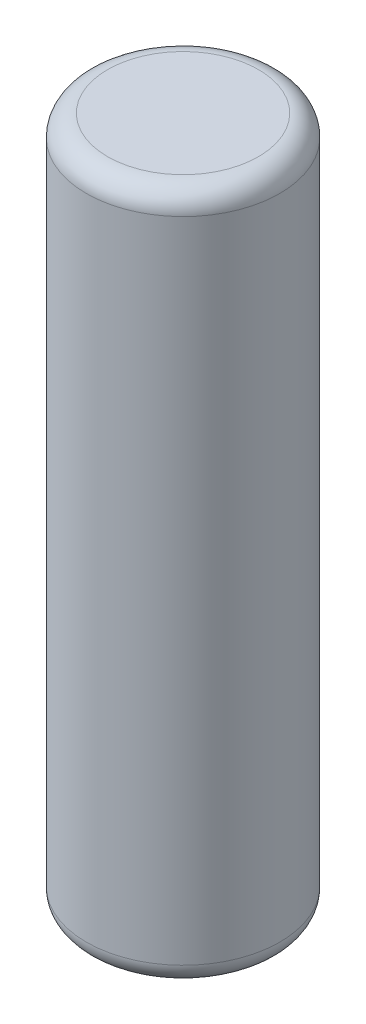
ISO-10303-21;
HEADER;
FILE_DESCRIPTION(('STEP AP214'),'2;1');
FILE_NAME('part.step','',(''),(''),'','','');
FILE_SCHEMA(('AUTOMOTIVE_DESIGN { 1 0 10303 214 1 1 1 1 }'));
ENDSEC;
DATA;
#1=APPLICATION_CONTEXT('core data for automotive mechanical design processes');
#2=APPLICATION_PROTOCOL_DEFINITION('international standard','automotive_design',2000,#1);
#3=PRODUCT_CONTEXT('',#1,'mechanical');
#4=PRODUCT('Part','Part','',(#3));
#5=PRODUCT_RELATED_PRODUCT_CATEGORY('part','',(#4));
#6=PRODUCT_DEFINITION_FORMATION('','',#4);
#7=PRODUCT_DEFINITION_CONTEXT('part definition',#1,'design');
#8=PRODUCT_DEFINITION('design','',#6,#7);
#9=PRODUCT_DEFINITION_SHAPE('','',#8);
#10=(LENGTH_UNIT() NAMED_UNIT(*) SI_UNIT(.MILLI.,.METRE.));
#11=(NAMED_UNIT(*) PLANE_ANGLE_UNIT() SI_UNIT($,.RADIAN.));
#12=(NAMED_UNIT(*) SI_UNIT($,.STERADIAN.) SOLID_ANGLE_UNIT());
#13=UNCERTAINTY_MEASURE_WITH_UNIT(LENGTH_MEASURE(1.E-05),#10,'distance_accuracy_value','');
#14=(GEOMETRIC_REPRESENTATION_CONTEXT(3) GLOBAL_UNCERTAINTY_ASSIGNED_CONTEXT((#13)) GLOBAL_UNIT_ASSIGNED_CONTEXT((#10,
#11,#12)) REPRESENTATION_CONTEXT('',''));
#15=CARTESIAN_POINT('',(0.,0.,0.));
#16=DIRECTION('',(0.,0.,1.));
#17=DIRECTION('',(1.,0.,0.));
#18=AXIS2_PLACEMENT_3D('',#15,#16,#17);
#19=CARTESIAN_POINT('',(0.,0.,0.));
#20=DIRECTION('',(0.,1.,0.));
#21=DIRECTION('',(0.,0.,1.));
#22=AXIS2_PLACEMENT_3D('',#19,#20,#21);
#23=PLANE('',#22);
#24=CARTESIAN_POINT('',(0.,0.,0.));
#25=DIRECTION('',(0.,1.,0.));
#26=DIRECTION('',(0.,0.,1.));
#27=AXIS2_PLACEMENT_3D('',#24,#25,#26);
#28=CIRCLE('',#27,7.09999999999999);
#29=CARTESIAN_POINT('',(0.,0.,7.09999999999999));
#30=VERTEX_POINT('',#29);
#31=EDGE_CURVE('E10',#30,#30,#28,.T.);
#32=ORIENTED_EDGE('',*,*,#31,.F.);
#33=EDGE_LOOP('',(#32));
#34=FACE_BOUND('',#33,.T.);
#35=ADVANCED_FACE('F33',(#34),#23,.F.);
#36=CARTESIAN_POINT('',(0.,2.,0.));
#37=DIRECTION('',(0.,1.,0.));
#38=DIRECTION('',(0.,0.,1.));
#39=AXIS2_PLACEMENT_3D('',#36,#37,#38);
#40=TOROIDAL_SURFACE('',#39,7.1,2.);
#41=CARTESIAN_POINT('',(0.,2.,0.));
#42=DIRECTION('',(0.,1.,0.));
#43=DIRECTION('',(0.,0.,1.));
#44=AXIS2_PLACEMENT_3D('',#41,#42,#43);
#45=CIRCLE('',#44,9.1);
#46=CARTESIAN_POINT('',(0.,2.,9.1));
#47=VERTEX_POINT('',#46);
#48=EDGE_CURVE('E39',#47,#47,#45,.T.);
#49=ORIENTED_EDGE('',*,*,#48,.F.);
#50=EDGE_LOOP('',(#49));
#51=FACE_BOUND('',#50,.T.);
#52=ORIENTED_EDGE('',*,*,#31,.T.);
#53=EDGE_LOOP('',(#52));
#54=FACE_BOUND('',#53,.T.);
#55=ADVANCED_FACE('F63',(#51,#54),#40,.T.);
#56=CARTESIAN_POINT('',(0.,65.,0.));
#57=DIRECTION('',(0.,1.,0.));
#58=DIRECTION('',(0.,0.,1.));
#59=AXIS2_PLACEMENT_3D('',#56,#57,#58);
#60=CYLINDRICAL_SURFACE('',#59,9.1);
#61=CARTESIAN_POINT('',(0.,63.,0.));
#62=DIRECTION('',(0.,1.,0.));
#63=DIRECTION('',(0.,0.,1.));
#64=AXIS2_PLACEMENT_3D('',#61,#62,#63);
#65=CIRCLE('',#64,9.1);
#66=CARTESIAN_POINT('',(0.,63.,9.1));
#67=VERTEX_POINT('',#66);
#68=EDGE_CURVE('E43',#67,#67,#65,.T.);
#69=ORIENTED_EDGE('',*,*,#68,.F.);
#70=EDGE_LOOP('',(#69));
#71=FACE_BOUND('',#70,.T.);
#72=ORIENTED_EDGE('',*,*,#48,.T.);
#73=EDGE_LOOP('',(#72));
#74=FACE_BOUND('',#73,.T.);
#75=ADVANCED_FACE('F58',(#71,#74),#60,.T.);
#76=CARTESIAN_POINT('',(0.,63.,0.));
#77=DIRECTION('',(0.,1.,0.));
#78=DIRECTION('',(0.,0.,1.));
#79=AXIS2_PLACEMENT_3D('',#76,#77,#78);
#80=TOROIDAL_SURFACE('',#79,7.1,2.);
#81=CARTESIAN_POINT('',(0.,65.,0.));
#82=DIRECTION('',(0.,1.,0.));
#83=DIRECTION('',(0.,0.,1.));
#84=AXIS2_PLACEMENT_3D('',#81,#82,#83);
#85=CIRCLE('',#84,7.09999999999999);
#86=CARTESIAN_POINT('',(0.,65.,7.09999999999999));
#87=VERTEX_POINT('',#86);
#88=EDGE_CURVE('E47',#87,#87,#85,.T.);
#89=ORIENTED_EDGE('',*,*,#88,.F.);
#90=EDGE_LOOP('',(#89));
#91=FACE_BOUND('',#90,.T.);
#92=ORIENTED_EDGE('',*,*,#68,.T.);
#93=EDGE_LOOP('',(#92));
#94=FACE_BOUND('',#93,.T.);
#95=ADVANCED_FACE('F55',(#91,#94),#80,.T.);
#96=CARTESIAN_POINT('',(7.09999999999999,65.,0.));
#97=DIRECTION('',(0.,-1.,0.));
#98=DIRECTION('',(0.,0.,-1.));
#99=AXIS2_PLACEMENT_3D('',#96,#97,#98);
#100=PLANE('',#99);
#101=ORIENTED_EDGE('',*,*,#88,.T.);
#102=EDGE_LOOP('',(#101));
#103=FACE_BOUND('',#102,.T.);
#104=ADVANCED_FACE('F53',(#103),#100,.F.);
#105=CLOSED_SHELL('',(#35,#55,#75,#95,#104));
#106=MANIFOLD_SOLID_BREP('B2',#105);
#107=ADVANCED_BREP_SHAPE_REPRESENTATION('',(#18,#106),#14);
#108=SHAPE_DEFINITION_REPRESENTATION(#9,#107);
ENDSEC;
END-ISO-10303-21;
